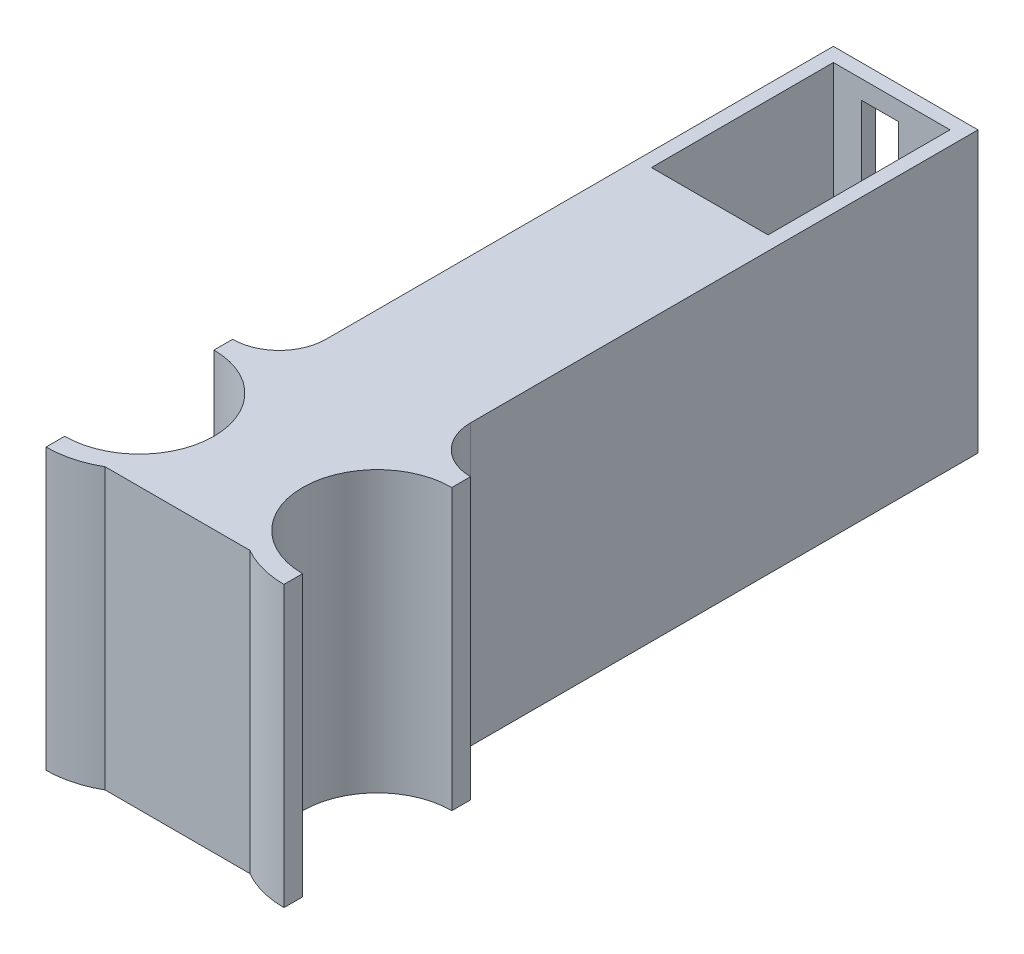
ISO-10303-21;
HEADER;
FILE_DESCRIPTION(('STEP AP214'),'2;1');
FILE_NAME('part.step','',(''),(''),'','','');
FILE_SCHEMA(('AUTOMOTIVE_DESIGN { 1 0 10303 214 1 1 1 1 }'));
ENDSEC;
DATA;
#1=APPLICATION_CONTEXT('core data for automotive mechanical design processes');
#2=APPLICATION_PROTOCOL_DEFINITION('international standard','automotive_design',2000,#1);
#3=PRODUCT_CONTEXT('',#1,'mechanical');
#4=PRODUCT('Part','Part','',(#3));
#5=PRODUCT_RELATED_PRODUCT_CATEGORY('part','',(#4));
#6=PRODUCT_DEFINITION_FORMATION('','',#4);
#7=PRODUCT_DEFINITION_CONTEXT('part definition',#1,'design');
#8=PRODUCT_DEFINITION('design','',#6,#7);
#9=PRODUCT_DEFINITION_SHAPE('','',#8);
#10=(LENGTH_UNIT() NAMED_UNIT(*) SI_UNIT(.MILLI.,.METRE.));
#11=(NAMED_UNIT(*) PLANE_ANGLE_UNIT() SI_UNIT($,.RADIAN.));
#12=(NAMED_UNIT(*) SI_UNIT($,.STERADIAN.) SOLID_ANGLE_UNIT());
#13=UNCERTAINTY_MEASURE_WITH_UNIT(LENGTH_MEASURE(1.E-05),#10,'distance_accuracy_value','');
#14=(GEOMETRIC_REPRESENTATION_CONTEXT(3) GLOBAL_UNCERTAINTY_ASSIGNED_CONTEXT((#13)) GLOBAL_UNIT_ASSIGNED_CONTEXT((#10,
#11,#12)) REPRESENTATION_CONTEXT('',''));
#15=CARTESIAN_POINT('',(0.,0.,0.));
#16=DIRECTION('',(0.,0.,1.));
#17=DIRECTION('',(1.,0.,0.));
#18=AXIS2_PLACEMENT_3D('',#15,#16,#17);
#19=CARTESIAN_POINT('',(0.,60.,0.));
#20=DIRECTION('',(0.,1.,0.));
#21=DIRECTION('',(0.,0.,1.));
#22=AXIS2_PLACEMENT_3D('',#19,#20,#21);
#23=PLANE('',#22);
#24=DIRECTION('',(0.,0.,1.));
#25=VECTOR('',#24,1.);
#26=CARTESIAN_POINT('',(-15.5,60.,-22.5));
#27=LINE('',#26,#25);
#28=CARTESIAN_POINT('',(-15.5,60.,-22.5));
#29=VERTEX_POINT('',#28);
#30=CARTESIAN_POINT('',(-15.5,60.,86.2574395006161));
#31=VERTEX_POINT('',#30);
#32=EDGE_CURVE('E322',#29,#31,#27,.T.);
#33=ORIENTED_EDGE('',*,*,#32,.T.);
#34=CARTESIAN_POINT('',(-25.5,60.,86.2574395006161));
#35=DIRECTION('',(0.,1.,0.));
#36=DIRECTION('',(0.,0.,1.));
#37=AXIS2_PLACEMENT_3D('',#34,#35,#36);
#38=CIRCLE('',#37,10.);
#39=CARTESIAN_POINT('',(-25.5,60.,96.2574395006161));
#40=VERTEX_POINT('',#39);
#41=EDGE_CURVE('E352',#31,#40,#38,.F.);
#42=ORIENTED_EDGE('',*,*,#41,.T.);
#43=DIRECTION('',(0.,0.,-1.));
#44=VECTOR('',#43,1.);
#45=CARTESIAN_POINT('',(-25.5,60.,0.));
#46=LINE('',#45,#44);
#47=CARTESIAN_POINT('',(-25.5,60.,100.257439500616));
#48=VERTEX_POINT('',#47);
#49=EDGE_CURVE('E252',#48,#40,#46,.T.);
#50=ORIENTED_EDGE('',*,*,#49,.F.);
#51=CARTESIAN_POINT('',(-25.5,60.,116.257439500616));
#52=DIRECTION('',(0.,1.,0.));
#53=DIRECTION('',(0.,0.,1.));
#54=AXIS2_PLACEMENT_3D('',#51,#52,#53);
#55=CIRCLE('',#54,16.);
#56=CARTESIAN_POINT('',(-25.5,60.,132.257439500616));
#57=VERTEX_POINT('',#56);
#58=EDGE_CURVE('E255',#57,#48,#55,.T.);
#59=ORIENTED_EDGE('',*,*,#58,.F.);
#60=DIRECTION('',(0.,0.,-1.));
#61=VECTOR('',#60,1.);
#62=CARTESIAN_POINT('',(-25.5,60.,0.));
#63=LINE('',#62,#61);
#64=CARTESIAN_POINT('',(-25.5,60.,136.257439500616));
#65=VERTEX_POINT('',#64);
#66=EDGE_CURVE('E257',#65,#57,#63,.T.);
#67=ORIENTED_EDGE('',*,*,#66,.F.);
#68=CARTESIAN_POINT('',(-25.5,60.,116.257439500616));
#69=DIRECTION('',(0.,1.,0.));
#70=DIRECTION('',(0.,0.,1.));
#71=AXIS2_PLACEMENT_3D('',#68,#69,#70);
#72=CIRCLE('',#71,20.);
#73=CARTESIAN_POINT('',(-15.5,60.,133.577947576305));
#74=VERTEX_POINT('',#73);
#75=EDGE_CURVE('E259',#65,#74,#72,.T.);
#76=ORIENTED_EDGE('',*,*,#75,.T.);
#77=DIRECTION('',(1.,0.,0.));
#78=VECTOR('',#77,1.);
#79=CARTESIAN_POINT('',(0.,60.,133.577947576305));
#80=LINE('',#79,#78);
#81=CARTESIAN_POINT('',(15.5,60.,133.577947576305));
#82=VERTEX_POINT('',#81);
#83=EDGE_CURVE('E262',#74,#82,#80,.T.);
#84=ORIENTED_EDGE('',*,*,#83,.T.);
#85=CARTESIAN_POINT('',(25.5,60.,116.257439500616));
#86=DIRECTION('',(0.,1.,0.));
#87=DIRECTION('',(0.,0.,1.));
#88=AXIS2_PLACEMENT_3D('',#85,#86,#87);
#89=CIRCLE('',#88,20.);
#90=CARTESIAN_POINT('',(25.5,60.,136.257439500616));
#91=VERTEX_POINT('',#90);
#92=EDGE_CURVE('E224',#91,#82,#89,.F.);
#93=ORIENTED_EDGE('',*,*,#92,.F.);
#94=DIRECTION('',(0.,0.,-1.));
#95=VECTOR('',#94,1.);
#96=CARTESIAN_POINT('',(25.5,60.,0.));
#97=LINE('',#96,#95);
#98=CARTESIAN_POINT('',(25.5,60.,132.257439500616));
#99=VERTEX_POINT('',#98);
#100=EDGE_CURVE('E217',#91,#99,#97,.T.);
#101=ORIENTED_EDGE('',*,*,#100,.T.);
#102=CARTESIAN_POINT('',(25.5,60.,116.257439500616));
#103=DIRECTION('',(0.,1.,0.));
#104=DIRECTION('',(0.,0.,1.));
#105=AXIS2_PLACEMENT_3D('',#102,#103,#104);
#106=CIRCLE('',#105,16.);
#107=CARTESIAN_POINT('',(25.5,60.,100.257439500616));
#108=VERTEX_POINT('',#107);
#109=EDGE_CURVE('E247',#99,#108,#106,.F.);
#110=ORIENTED_EDGE('',*,*,#109,.T.);
#111=DIRECTION('',(0.,0.,-1.));
#112=VECTOR('',#111,1.);
#113=CARTESIAN_POINT('',(25.4999999999998,60.,0.));
#114=LINE('',#113,#112);
#115=CARTESIAN_POINT('',(25.5,60.,96.2574395006161));
#116=VERTEX_POINT('',#115);
#117=EDGE_CURVE('E250',#108,#116,#114,.T.);
#118=ORIENTED_EDGE('',*,*,#117,.T.);
#119=CARTESIAN_POINT('',(25.5,60.,86.2574395006161));
#120=DIRECTION('',(0.,1.,0.));
#121=DIRECTION('',(0.,0.,1.));
#122=AXIS2_PLACEMENT_3D('',#119,#120,#121);
#123=CIRCLE('',#122,10.);
#124=CARTESIAN_POINT('',(15.5,60.,86.2574395006161));
#125=VERTEX_POINT('',#124);
#126=EDGE_CURVE('E45',#116,#125,#123,.F.);
#127=ORIENTED_EDGE('',*,*,#126,.T.);
#128=DIRECTION('',(0.,0.,-1.));
#129=VECTOR('',#128,1.);
#130=CARTESIAN_POINT('',(15.5,60.,-22.5));
#131=LINE('',#130,#129);
#132=CARTESIAN_POINT('',(15.5,60.,-22.5));
#133=VERTEX_POINT('',#132);
#134=EDGE_CURVE('E325',#125,#133,#131,.T.);
#135=ORIENTED_EDGE('',*,*,#134,.T.);
#136=DIRECTION('',(-1.,0.,0.));
#137=VECTOR('',#136,1.);
#138=CARTESIAN_POINT('',(-15.5,60.,-22.5));
#139=LINE('',#138,#137);
#140=EDGE_CURVE('E328',#133,#29,#139,.T.);
#141=ORIENTED_EDGE('',*,*,#140,.T.);
#142=EDGE_LOOP('',(#33,#42,#50,#59,#67,#76,#84,#93,#101,#110,#118,#127,#135,#141));
#143=FACE_BOUND('',#142,.T.);
#144=DIRECTION('',(-1.,0.,0.));
#145=VECTOR('',#144,1.);
#146=CARTESIAN_POINT('',(-12.5,60.,-19.5));
#147=LINE('',#146,#145);
#148=CARTESIAN_POINT('',(12.5,60.,-19.5));
#149=VERTEX_POINT('',#148);
#150=CARTESIAN_POINT('',(-12.5,60.,-19.5));
#151=VERTEX_POINT('',#150);
#152=EDGE_CURVE('E293',#149,#151,#147,.T.);
#153=ORIENTED_EDGE('',*,*,#152,.F.);
#154=DIRECTION('',(0.,0.,-1.));
#155=VECTOR('',#154,1.);
#156=CARTESIAN_POINT('',(12.5,60.,-19.5));
#157=LINE('',#156,#155);
#158=CARTESIAN_POINT('',(12.5,60.,19.5));
#159=VERTEX_POINT('',#158);
#160=EDGE_CURVE('E291',#159,#149,#157,.T.);
#161=ORIENTED_EDGE('',*,*,#160,.F.);
#162=DIRECTION('',(1.,0.,0.));
#163=VECTOR('',#162,1.);
#164=CARTESIAN_POINT('',(-12.5,60.,19.5));
#165=LINE('',#164,#163);
#166=CARTESIAN_POINT('',(-12.5,60.,19.5));
#167=VERTEX_POINT('',#166);
#168=EDGE_CURVE('E299',#167,#159,#165,.T.);
#169=ORIENTED_EDGE('',*,*,#168,.F.);
#170=DIRECTION('',(0.,0.,1.));
#171=VECTOR('',#170,1.);
#172=CARTESIAN_POINT('',(-12.5,60.,-19.5));
#173=LINE('',#172,#171);
#174=EDGE_CURVE('E296',#151,#167,#173,.T.);
#175=ORIENTED_EDGE('',*,*,#174,.F.);
#176=EDGE_LOOP('',(#153,#161,#169,#175));
#177=FACE_BOUND('',#176,.T.);
#178=ADVANCED_FACE('F37',(#143,#177),#23,.T.);
#179=CARTESIAN_POINT('',(0.,0.,0.));
#180=DIRECTION('',(0.,1.,0.));
#181=DIRECTION('',(0.,0.,1.));
#182=AXIS2_PLACEMENT_3D('',#179,#180,#181);
#183=PLANE('',#182);
#184=DIRECTION('',(0.,0.,1.));
#185=VECTOR('',#184,1.);
#186=CARTESIAN_POINT('',(-15.5,0.,-22.5));
#187=LINE('',#186,#185);
#188=CARTESIAN_POINT('',(-15.5,0.,-22.5));
#189=VERTEX_POINT('',#188);
#190=CARTESIAN_POINT('',(-15.5,0.,86.2574395006161));
#191=VERTEX_POINT('',#190);
#192=EDGE_CURVE('E321',#189,#191,#187,.T.);
#193=ORIENTED_EDGE('',*,*,#192,.F.);
#194=DIRECTION('',(-1.,0.,0.));
#195=VECTOR('',#194,1.);
#196=CARTESIAN_POINT('',(-15.5,0.,-22.5));
#197=LINE('',#196,#195);
#198=CARTESIAN_POINT('',(15.5,0.,-22.5));
#199=VERTEX_POINT('',#198);
#200=EDGE_CURVE('E326',#199,#189,#197,.T.);
#201=ORIENTED_EDGE('',*,*,#200,.F.);
#202=DIRECTION('',(0.,0.,-1.));
#203=VECTOR('',#202,1.);
#204=CARTESIAN_POINT('',(15.5,0.,-22.5));
#205=LINE('',#204,#203);
#206=CARTESIAN_POINT('',(15.5,0.,86.2574395006161));
#207=VERTEX_POINT('',#206);
#208=EDGE_CURVE('E333',#207,#199,#205,.T.);
#209=ORIENTED_EDGE('',*,*,#208,.F.);
#210=CARTESIAN_POINT('',(25.5,0.,86.2574395006161));
#211=DIRECTION('',(0.,1.,0.));
#212=DIRECTION('',(0.,0.,1.));
#213=AXIS2_PLACEMENT_3D('',#210,#211,#212);
#214=CIRCLE('',#213,10.);
#215=CARTESIAN_POINT('',(25.5,0.,96.2574395006161));
#216=VERTEX_POINT('',#215);
#217=EDGE_CURVE('E11',#207,#216,#214,.T.);
#218=ORIENTED_EDGE('',*,*,#217,.T.);
#219=DIRECTION('',(0.,0.,-1.));
#220=VECTOR('',#219,1.);
#221=CARTESIAN_POINT('',(25.4999999999998,0.,0.));
#222=LINE('',#221,#220);
#223=CARTESIAN_POINT('',(25.5,0.,100.257439500616));
#224=VERTEX_POINT('',#223);
#225=EDGE_CURVE('E227',#224,#216,#222,.T.);
#226=ORIENTED_EDGE('',*,*,#225,.F.);
#227=CARTESIAN_POINT('',(25.5,0.,116.257439500616));
#228=DIRECTION('',(0.,1.,0.));
#229=DIRECTION('',(0.,0.,1.));
#230=AXIS2_PLACEMENT_3D('',#227,#228,#229);
#231=CIRCLE('',#230,16.);
#232=CARTESIAN_POINT('',(25.5,0.,132.257439500616));
#233=VERTEX_POINT('',#232);
#234=EDGE_CURVE('E223',#233,#224,#231,.F.);
#235=ORIENTED_EDGE('',*,*,#234,.F.);
#236=DIRECTION('',(0.,0.,-1.));
#237=VECTOR('',#236,1.);
#238=CARTESIAN_POINT('',(25.5,0.,0.));
#239=LINE('',#238,#237);
#240=CARTESIAN_POINT('',(25.5,0.,136.257439500616));
#241=VERTEX_POINT('',#240);
#242=EDGE_CURVE('E220',#241,#233,#239,.T.);
#243=ORIENTED_EDGE('',*,*,#242,.F.);
#244=CARTESIAN_POINT('',(25.5,0.,116.257439500616));
#245=DIRECTION('',(0.,1.,0.));
#246=DIRECTION('',(0.,0.,1.));
#247=AXIS2_PLACEMENT_3D('',#244,#245,#246);
#248=CIRCLE('',#247,20.);
#249=CARTESIAN_POINT('',(15.5,0.,133.577947576305));
#250=VERTEX_POINT('',#249);
#251=EDGE_CURVE('E242',#241,#250,#248,.F.);
#252=ORIENTED_EDGE('',*,*,#251,.T.);
#253=DIRECTION('',(1.,0.,0.));
#254=VECTOR('',#253,1.);
#255=CARTESIAN_POINT('',(0.,0.,133.577947576305));
#256=LINE('',#255,#254);
#257=CARTESIAN_POINT('',(-15.5,0.,133.577947576305));
#258=VERTEX_POINT('',#257);
#259=EDGE_CURVE('E239',#258,#250,#256,.T.);
#260=ORIENTED_EDGE('',*,*,#259,.F.);
#261=CARTESIAN_POINT('',(-25.5,0.,116.257439500616));
#262=DIRECTION('',(0.,1.,0.));
#263=DIRECTION('',(0.,0.,1.));
#264=AXIS2_PLACEMENT_3D('',#261,#262,#263);
#265=CIRCLE('',#264,20.);
#266=CARTESIAN_POINT('',(-25.5,0.,136.257439500616));
#267=VERTEX_POINT('',#266);
#268=EDGE_CURVE('E236',#267,#258,#265,.T.);
#269=ORIENTED_EDGE('',*,*,#268,.F.);
#270=DIRECTION('',(0.,0.,-1.));
#271=VECTOR('',#270,1.);
#272=CARTESIAN_POINT('',(-25.5,0.,0.));
#273=LINE('',#272,#271);
#274=CARTESIAN_POINT('',(-25.5,0.,132.257439500616));
#275=VERTEX_POINT('',#274);
#276=EDGE_CURVE('E234',#267,#275,#273,.T.);
#277=ORIENTED_EDGE('',*,*,#276,.T.);
#278=CARTESIAN_POINT('',(-25.5,0.,116.257439500616));
#279=DIRECTION('',(0.,1.,0.));
#280=DIRECTION('',(0.,0.,1.));
#281=AXIS2_PLACEMENT_3D('',#278,#279,#280);
#282=CIRCLE('',#281,16.);
#283=CARTESIAN_POINT('',(-25.5,0.,100.257439500616));
#284=VERTEX_POINT('',#283);
#285=EDGE_CURVE('E232',#275,#284,#282,.T.);
#286=ORIENTED_EDGE('',*,*,#285,.T.);
#287=DIRECTION('',(0.,0.,-1.));
#288=VECTOR('',#287,1.);
#289=CARTESIAN_POINT('',(-25.5,0.,0.));
#290=LINE('',#289,#288);
#291=CARTESIAN_POINT('',(-25.5,0.,96.2574395006161));
#292=VERTEX_POINT('',#291);
#293=EDGE_CURVE('E230',#284,#292,#290,.T.);
#294=ORIENTED_EDGE('',*,*,#293,.T.);
#295=CARTESIAN_POINT('',(-25.5,0.,86.2574395006161));
#296=DIRECTION('',(0.,1.,0.));
#297=DIRECTION('',(0.,0.,1.));
#298=AXIS2_PLACEMENT_3D('',#295,#296,#297);
#299=CIRCLE('',#298,10.);
#300=EDGE_CURVE('E354',#292,#191,#299,.T.);
#301=ORIENTED_EDGE('',*,*,#300,.T.);
#302=EDGE_LOOP('',(#193,#201,#209,#218,#226,#235,#243,#252,#260,#269,#277,#286,#294,#301));
#303=FACE_BOUND('',#302,.T.);
#304=DIRECTION('',(0.,0.,-1.));
#305=VECTOR('',#304,1.);
#306=CARTESIAN_POINT('',(12.5,0.,-19.5));
#307=LINE('',#306,#305);
#308=CARTESIAN_POINT('',(12.5,0.,19.5));
#309=VERTEX_POINT('',#308);
#310=CARTESIAN_POINT('',(12.5,0.,-19.5));
#311=VERTEX_POINT('',#310);
#312=EDGE_CURVE('E269',#309,#311,#307,.T.);
#313=ORIENTED_EDGE('',*,*,#312,.T.);
#314=DIRECTION('',(-1.,0.,0.));
#315=VECTOR('',#314,1.);
#316=CARTESIAN_POINT('',(-12.5,0.,-19.5));
#317=LINE('',#316,#315);
#318=CARTESIAN_POINT('',(-12.5,0.,-19.5));
#319=VERTEX_POINT('',#318);
#320=EDGE_CURVE('E304',#311,#319,#317,.T.);
#321=ORIENTED_EDGE('',*,*,#320,.T.);
#322=DIRECTION('',(0.,0.,1.));
#323=VECTOR('',#322,1.);
#324=CARTESIAN_POINT('',(-12.5,0.,-19.5));
#325=LINE('',#324,#323);
#326=CARTESIAN_POINT('',(-12.5,0.,19.5));
#327=VERTEX_POINT('',#326);
#328=EDGE_CURVE('E307',#319,#327,#325,.T.);
#329=ORIENTED_EDGE('',*,*,#328,.T.);
#330=DIRECTION('',(1.,0.,0.));
#331=VECTOR('',#330,1.);
#332=CARTESIAN_POINT('',(-12.5,0.,19.5));
#333=LINE('',#332,#331);
#334=EDGE_CURVE('E294',#327,#309,#333,.T.);
#335=ORIENTED_EDGE('',*,*,#334,.T.);
#336=EDGE_LOOP('',(#313,#321,#329,#335));
#337=FACE_BOUND('',#336,.T.);
#338=ADVANCED_FACE('F358',(#303,#337),#183,.F.);
#339=CARTESIAN_POINT('',(-15.5,60.,-22.5));
#340=DIRECTION('',(1.,0.,0.));
#341=DIRECTION('',(0.,0.,-1.));
#342=AXIS2_PLACEMENT_3D('',#339,#340,#341);
#343=PLANE('',#342);
#344=ORIENTED_EDGE('',*,*,#192,.T.);
#345=DIRECTION('',(0.,1.,0.));
#346=VECTOR('',#345,1.);
#347=CARTESIAN_POINT('',(-15.5,60.,86.2574395006161));
#348=LINE('',#347,#346);
#349=EDGE_CURVE('E348',#191,#31,#348,.T.);
#350=ORIENTED_EDGE('',*,*,#349,.T.);
#351=ORIENTED_EDGE('',*,*,#32,.F.);
#352=DIRECTION('',(0.,-1.,0.));
#353=VECTOR('',#352,1.);
#354=CARTESIAN_POINT('',(-15.5,60.,-22.5));
#355=LINE('',#354,#353);
#356=EDGE_CURVE('E330',#29,#189,#355,.T.);
#357=ORIENTED_EDGE('',*,*,#356,.T.);
#358=EDGE_LOOP('',(#344,#350,#351,#357));
#359=FACE_BOUND('',#358,.T.);
#360=ADVANCED_FACE('F366',(#359),#343,.F.);
#361=CARTESIAN_POINT('',(15.5,60.,-22.5));
#362=DIRECTION('',(-1.,0.,0.));
#363=DIRECTION('',(0.,0.,1.));
#364=AXIS2_PLACEMENT_3D('',#361,#362,#363);
#365=PLANE('',#364);
#366=ORIENTED_EDGE('',*,*,#134,.F.);
#367=DIRECTION('',(0.,-1.,0.));
#368=VECTOR('',#367,1.);
#369=CARTESIAN_POINT('',(15.5,0.,86.2574395006161));
#370=LINE('',#369,#368);
#371=EDGE_CURVE('E58',#125,#207,#370,.T.);
#372=ORIENTED_EDGE('',*,*,#371,.T.);
#373=ORIENTED_EDGE('',*,*,#208,.T.);
#374=DIRECTION('',(0.,-1.,0.));
#375=VECTOR('',#374,1.);
#376=CARTESIAN_POINT('',(15.5,60.,-22.5));
#377=LINE('',#376,#375);
#378=EDGE_CURVE('E338',#133,#199,#377,.T.);
#379=ORIENTED_EDGE('',*,*,#378,.F.);
#380=EDGE_LOOP('',(#366,#372,#373,#379));
#381=FACE_BOUND('',#380,.T.);
#382=ADVANCED_FACE('F411',(#381),#365,.F.);
#383=CARTESIAN_POINT('',(-15.5,60.,-22.5));
#384=DIRECTION('',(0.,0.,1.));
#385=DIRECTION('',(1.,0.,0.));
#386=AXIS2_PLACEMENT_3D('',#383,#384,#385);
#387=PLANE('',#386);
#388=DIRECTION('',(0.,-1.,0.));
#389=VECTOR('',#388,1.);
#390=CARTESIAN_POINT('',(1.49999999999999,56.,-22.5));
#391=LINE('',#390,#389);
#392=CARTESIAN_POINT('',(1.49999999999999,56.,-22.5));
#393=VERTEX_POINT('',#392);
#394=CARTESIAN_POINT('',(1.49999999999999,4.,-22.5));
#395=VERTEX_POINT('',#394);
#396=EDGE_CURVE('E200',#393,#395,#391,.T.);
#397=ORIENTED_EDGE('',*,*,#396,.F.);
#398=DIRECTION('',(1.,0.,0.));
#399=VECTOR('',#398,1.);
#400=CARTESIAN_POINT('',(1.49999999999999,56.,-22.5));
#401=LINE('',#400,#399);
#402=CARTESIAN_POINT('',(-6.50000000000001,56.,-22.5));
#403=VERTEX_POINT('',#402);
#404=EDGE_CURVE('E205',#403,#393,#401,.T.);
#405=ORIENTED_EDGE('',*,*,#404,.F.);
#406=DIRECTION('',(0.,1.,0.));
#407=VECTOR('',#406,1.);
#408=CARTESIAN_POINT('',(-6.50000000000001,56.,-22.5));
#409=LINE('',#408,#407);
#410=CARTESIAN_POINT('',(-6.50000000000001,4.,-22.5));
#411=VERTEX_POINT('',#410);
#412=EDGE_CURVE('E210',#411,#403,#409,.T.);
#413=ORIENTED_EDGE('',*,*,#412,.F.);
#414=DIRECTION('',(-1.,0.,0.));
#415=VECTOR('',#414,1.);
#416=CARTESIAN_POINT('',(1.49999999999999,4.,-22.5));
#417=LINE('',#416,#415);
#418=EDGE_CURVE('E189',#395,#411,#417,.T.);
#419=ORIENTED_EDGE('',*,*,#418,.F.);
#420=EDGE_LOOP('',(#397,#405,#413,#419));
#421=FACE_BOUND('',#420,.T.);
#422=ORIENTED_EDGE('',*,*,#200,.T.);
#423=ORIENTED_EDGE('',*,*,#356,.F.);
#424=ORIENTED_EDGE('',*,*,#140,.F.);
#425=ORIENTED_EDGE('',*,*,#378,.T.);
#426=EDGE_LOOP('',(#422,#423,#424,#425));
#427=FACE_BOUND('',#426,.T.);
#428=ADVANCED_FACE('F207',(#421,#427),#387,.F.);
#429=CARTESIAN_POINT('',(12.5,60.,-19.5));
#430=DIRECTION('',(-1.,0.,0.));
#431=DIRECTION('',(0.,0.,1.));
#432=AXIS2_PLACEMENT_3D('',#429,#430,#431);
#433=PLANE('',#432);
#434=ORIENTED_EDGE('',*,*,#312,.F.);
#435=DIRECTION('',(0.,-1.,0.));
#436=VECTOR('',#435,1.);
#437=CARTESIAN_POINT('',(12.5,60.,19.5));
#438=LINE('',#437,#436);
#439=EDGE_CURVE('E301',#159,#309,#438,.T.);
#440=ORIENTED_EDGE('',*,*,#439,.F.);
#441=ORIENTED_EDGE('',*,*,#160,.T.);
#442=DIRECTION('',(0.,-1.,0.));
#443=VECTOR('',#442,1.);
#444=CARTESIAN_POINT('',(12.5,60.,-19.5));
#445=LINE('',#444,#443);
#446=EDGE_CURVE('E318',#149,#311,#445,.T.);
#447=ORIENTED_EDGE('',*,*,#446,.T.);
#448=EDGE_LOOP('',(#434,#440,#441,#447));
#449=FACE_BOUND('',#448,.T.);
#450=ADVANCED_FACE('F414',(#449),#433,.T.);
#451=CARTESIAN_POINT('',(-12.5,60.,-19.5));
#452=DIRECTION('',(0.,0.,1.));
#453=DIRECTION('',(1.,0.,0.));
#454=AXIS2_PLACEMENT_3D('',#451,#452,#453);
#455=PLANE('',#454);
#456=DIRECTION('',(-1.,0.,0.));
#457=VECTOR('',#456,1.);
#458=CARTESIAN_POINT('',(-12.5,56.,-19.5));
#459=LINE('',#458,#457);
#460=CARTESIAN_POINT('',(1.49999999999999,56.,-19.5));
#461=VERTEX_POINT('',#460);
#462=CARTESIAN_POINT('',(-6.50000000000001,56.,-19.5));
#463=VERTEX_POINT('',#462);
#464=EDGE_CURVE('E346',#461,#463,#459,.T.);
#465=ORIENTED_EDGE('',*,*,#464,.F.);
#466=DIRECTION('',(0.,1.,0.));
#467=VECTOR('',#466,1.);
#468=CARTESIAN_POINT('',(1.49999999999999,60.,-19.5));
#469=LINE('',#468,#467);
#470=CARTESIAN_POINT('',(1.49999999999999,4.,-19.5));
#471=VERTEX_POINT('',#470);
#472=EDGE_CURVE('E341',#471,#461,#469,.T.);
#473=ORIENTED_EDGE('',*,*,#472,.F.);
#474=DIRECTION('',(1.,0.,0.));
#475=VECTOR('',#474,1.);
#476=CARTESIAN_POINT('',(-12.5,4.,-19.5));
#477=LINE('',#476,#475);
#478=CARTESIAN_POINT('',(-6.50000000000001,4.,-19.5));
#479=VERTEX_POINT('',#478);
#480=EDGE_CURVE('E192',#479,#471,#477,.T.);
#481=ORIENTED_EDGE('',*,*,#480,.F.);
#482=DIRECTION('',(0.,-1.,0.));
#483=VECTOR('',#482,1.);
#484=CARTESIAN_POINT('',(-6.50000000000001,60.,-19.5));
#485=LINE('',#484,#483);
#486=EDGE_CURVE('E344',#463,#479,#485,.T.);
#487=ORIENTED_EDGE('',*,*,#486,.F.);
#488=EDGE_LOOP('',(#465,#473,#481,#487));
#489=FACE_BOUND('',#488,.T.);
#490=ORIENTED_EDGE('',*,*,#320,.F.);
#491=ORIENTED_EDGE('',*,*,#446,.F.);
#492=ORIENTED_EDGE('',*,*,#152,.T.);
#493=DIRECTION('',(0.,-1.,0.));
#494=VECTOR('',#493,1.);
#495=CARTESIAN_POINT('',(-12.5,60.,-19.5));
#496=LINE('',#495,#494);
#497=EDGE_CURVE('E316',#151,#319,#496,.T.);
#498=ORIENTED_EDGE('',*,*,#497,.T.);
#499=EDGE_LOOP('',(#490,#491,#492,#498));
#500=FACE_BOUND('',#499,.T.);
#501=ADVANCED_FACE('F420',(#489,#500),#455,.T.);
#502=CARTESIAN_POINT('',(-12.5,60.,-19.5));
#503=DIRECTION('',(1.,0.,0.));
#504=DIRECTION('',(0.,0.,-1.));
#505=AXIS2_PLACEMENT_3D('',#502,#503,#504);
#506=PLANE('',#505);
#507=ORIENTED_EDGE('',*,*,#328,.F.);
#508=ORIENTED_EDGE('',*,*,#497,.F.);
#509=ORIENTED_EDGE('',*,*,#174,.T.);
#510=DIRECTION('',(0.,-1.,0.));
#511=VECTOR('',#510,1.);
#512=CARTESIAN_POINT('',(-12.5,60.,19.5));
#513=LINE('',#512,#511);
#514=EDGE_CURVE('E314',#167,#327,#513,.T.);
#515=ORIENTED_EDGE('',*,*,#514,.T.);
#516=EDGE_LOOP('',(#507,#508,#509,#515));
#517=FACE_BOUND('',#516,.T.);
#518=ADVANCED_FACE('F433',(#517),#506,.T.);
#519=CARTESIAN_POINT('',(-12.5,60.,19.5));
#520=DIRECTION('',(0.,0.,-1.));
#521=DIRECTION('',(-1.,0.,0.));
#522=AXIS2_PLACEMENT_3D('',#519,#520,#521);
#523=PLANE('',#522);
#524=ORIENTED_EDGE('',*,*,#334,.F.);
#525=ORIENTED_EDGE('',*,*,#514,.F.);
#526=ORIENTED_EDGE('',*,*,#168,.T.);
#527=ORIENTED_EDGE('',*,*,#439,.T.);
#528=EDGE_LOOP('',(#524,#525,#526,#527));
#529=FACE_BOUND('',#528,.T.);
#530=ADVANCED_FACE('F437',(#529),#523,.T.);
#531=CARTESIAN_POINT('',(25.5,0.,0.));
#532=DIRECTION('',(1.,0.,0.));
#533=DIRECTION('',(0.,0.,-1.));
#534=AXIS2_PLACEMENT_3D('',#531,#532,#533);
#535=PLANE('',#534);
#536=ORIENTED_EDGE('',*,*,#100,.F.);
#537=DIRECTION('',(0.,1.,0.));
#538=VECTOR('',#537,1.);
#539=CARTESIAN_POINT('',(25.5,0.,136.257439500616));
#540=LINE('',#539,#538);
#541=EDGE_CURVE('E267',#241,#91,#540,.T.);
#542=ORIENTED_EDGE('',*,*,#541,.F.);
#543=ORIENTED_EDGE('',*,*,#242,.T.);
#544=DIRECTION('',(0.,1.,0.));
#545=VECTOR('',#544,1.);
#546=CARTESIAN_POINT('',(25.5,0.,132.257439500616));
#547=LINE('',#546,#545);
#548=EDGE_CURVE('E244',#233,#99,#547,.T.);
#549=ORIENTED_EDGE('',*,*,#548,.T.);
#550=EDGE_LOOP('',(#536,#542,#543,#549));
#551=FACE_BOUND('',#550,.T.);
#552=ADVANCED_FACE('F396',(#551),#535,.T.);
#553=CARTESIAN_POINT('',(25.5,0.,116.257439500616));
#554=DIRECTION('',(0.,1.,0.));
#555=DIRECTION('',(0.,0.,1.));
#556=AXIS2_PLACEMENT_3D('',#553,#554,#555);
#557=CYLINDRICAL_SURFACE('',#556,20.);
#558=ORIENTED_EDGE('',*,*,#92,.T.);
#559=DIRECTION('',(0.,1.,0.));
#560=VECTOR('',#559,1.);
#561=CARTESIAN_POINT('',(15.5,0.,133.577947576305));
#562=LINE('',#561,#560);
#563=EDGE_CURVE('E270',#250,#82,#562,.T.);
#564=ORIENTED_EDGE('',*,*,#563,.F.);
#565=ORIENTED_EDGE('',*,*,#251,.F.);
#566=ORIENTED_EDGE('',*,*,#541,.T.);
#567=EDGE_LOOP('',(#558,#564,#565,#566));
#568=FACE_BOUND('',#567,.T.);
#569=ADVANCED_FACE('F444',(#568),#557,.T.);
#570=CARTESIAN_POINT('',(0.,0.,133.577947576305));
#571=DIRECTION('',(0.,0.,1.));
#572=DIRECTION('',(1.,0.,0.));
#573=AXIS2_PLACEMENT_3D('',#570,#571,#572);
#574=PLANE('',#573);
#575=ORIENTED_EDGE('',*,*,#83,.F.);
#576=DIRECTION('',(0.,1.,0.));
#577=VECTOR('',#576,1.);
#578=CARTESIAN_POINT('',(-15.5,0.,133.577947576305));
#579=LINE('',#578,#577);
#580=EDGE_CURVE('E272',#258,#74,#579,.T.);
#581=ORIENTED_EDGE('',*,*,#580,.F.);
#582=ORIENTED_EDGE('',*,*,#259,.T.);
#583=ORIENTED_EDGE('',*,*,#563,.T.);
#584=EDGE_LOOP('',(#575,#581,#582,#583));
#585=FACE_BOUND('',#584,.T.);
#586=ADVANCED_FACE('F390',(#585),#574,.T.);
#587=CARTESIAN_POINT('',(-25.5,0.,116.257439500616));
#588=DIRECTION('',(0.,1.,0.));
#589=DIRECTION('',(0.,0.,1.));
#590=AXIS2_PLACEMENT_3D('',#587,#588,#589);
#591=CYLINDRICAL_SURFACE('',#590,20.);
#592=ORIENTED_EDGE('',*,*,#75,.F.);
#593=DIRECTION('',(0.,1.,0.));
#594=VECTOR('',#593,1.);
#595=CARTESIAN_POINT('',(-25.5,0.,136.257439500616));
#596=LINE('',#595,#594);
#597=EDGE_CURVE('E274',#267,#65,#596,.T.);
#598=ORIENTED_EDGE('',*,*,#597,.F.);
#599=ORIENTED_EDGE('',*,*,#268,.T.);
#600=ORIENTED_EDGE('',*,*,#580,.T.);
#601=EDGE_LOOP('',(#592,#598,#599,#600));
#602=FACE_BOUND('',#601,.T.);
#603=ADVANCED_FACE('F384',(#602),#591,.T.);
#604=CARTESIAN_POINT('',(-25.5,0.,0.));
#605=DIRECTION('',(1.,0.,0.));
#606=DIRECTION('',(0.,0.,-1.));
#607=AXIS2_PLACEMENT_3D('',#604,#605,#606);
#608=PLANE('',#607);
#609=ORIENTED_EDGE('',*,*,#66,.T.);
#610=DIRECTION('',(0.,1.,0.));
#611=VECTOR('',#610,1.);
#612=CARTESIAN_POINT('',(-25.5,0.,132.257439500616));
#613=LINE('',#612,#611);
#614=EDGE_CURVE('E276',#275,#57,#613,.T.);
#615=ORIENTED_EDGE('',*,*,#614,.F.);
#616=ORIENTED_EDGE('',*,*,#276,.F.);
#617=ORIENTED_EDGE('',*,*,#597,.T.);
#618=EDGE_LOOP('',(#609,#615,#616,#617));
#619=FACE_BOUND('',#618,.T.);
#620=ADVANCED_FACE('F454',(#619),#608,.F.);
#621=CARTESIAN_POINT('',(-25.5,0.,116.257439500616));
#622=DIRECTION('',(0.,1.,0.));
#623=DIRECTION('',(0.,0.,1.));
#624=AXIS2_PLACEMENT_3D('',#621,#622,#623);
#625=CYLINDRICAL_SURFACE('',#624,16.);
#626=ORIENTED_EDGE('',*,*,#58,.T.);
#627=DIRECTION('',(0.,1.,0.));
#628=VECTOR('',#627,1.);
#629=CARTESIAN_POINT('',(-25.5,0.,100.257439500616));
#630=LINE('',#629,#628);
#631=EDGE_CURVE('E279',#284,#48,#630,.T.);
#632=ORIENTED_EDGE('',*,*,#631,.F.);
#633=ORIENTED_EDGE('',*,*,#285,.F.);
#634=ORIENTED_EDGE('',*,*,#614,.T.);
#635=EDGE_LOOP('',(#626,#632,#633,#634));
#636=FACE_BOUND('',#635,.T.);
#637=ADVANCED_FACE('F378',(#636),#625,.F.);
#638=CARTESIAN_POINT('',(-25.5,0.,0.));
#639=DIRECTION('',(1.,0.,0.));
#640=DIRECTION('',(0.,0.,-1.));
#641=AXIS2_PLACEMENT_3D('',#638,#639,#640);
#642=PLANE('',#641);
#643=ORIENTED_EDGE('',*,*,#49,.T.);
#644=DIRECTION('',(0.,1.,0.));
#645=VECTOR('',#644,1.);
#646=CARTESIAN_POINT('',(-25.5,0.,96.2574395006161));
#647=LINE('',#646,#645);
#648=EDGE_CURVE('E282',#292,#40,#647,.T.);
#649=ORIENTED_EDGE('',*,*,#648,.F.);
#650=ORIENTED_EDGE('',*,*,#293,.F.);
#651=ORIENTED_EDGE('',*,*,#631,.T.);
#652=EDGE_LOOP('',(#643,#649,#650,#651));
#653=FACE_BOUND('',#652,.T.);
#654=ADVANCED_FACE('F374',(#653),#642,.F.);
#655=CARTESIAN_POINT('',(25.4999999999998,0.,0.));
#656=DIRECTION('',(1.,0.,0.));
#657=DIRECTION('',(0.,0.,-1.));
#658=AXIS2_PLACEMENT_3D('',#655,#656,#657);
#659=PLANE('',#658);
#660=ORIENTED_EDGE('',*,*,#117,.F.);
#661=DIRECTION('',(0.,1.,0.));
#662=VECTOR('',#661,1.);
#663=CARTESIAN_POINT('',(25.5,0.,100.257439500616));
#664=LINE('',#663,#662);
#665=EDGE_CURVE('E288',#224,#108,#664,.T.);
#666=ORIENTED_EDGE('',*,*,#665,.F.);
#667=ORIENTED_EDGE('',*,*,#225,.T.);
#668=DIRECTION('',(0.,1.,0.));
#669=VECTOR('',#668,1.);
#670=CARTESIAN_POINT('',(25.5,0.,96.2574395006161));
#671=LINE('',#670,#669);
#672=EDGE_CURVE('E285',#216,#116,#671,.T.);
#673=ORIENTED_EDGE('',*,*,#672,.T.);
#674=EDGE_LOOP('',(#660,#666,#667,#673));
#675=FACE_BOUND('',#674,.T.);
#676=ADVANCED_FACE('F405',(#675),#659,.T.);
#677=CARTESIAN_POINT('',(25.5,0.,116.257439500616));
#678=DIRECTION('',(0.,1.,0.));
#679=DIRECTION('',(0.,0.,1.));
#680=AXIS2_PLACEMENT_3D('',#677,#678,#679);
#681=CYLINDRICAL_SURFACE('',#680,16.);
#682=ORIENTED_EDGE('',*,*,#109,.F.);
#683=ORIENTED_EDGE('',*,*,#548,.F.);
#684=ORIENTED_EDGE('',*,*,#234,.T.);
#685=ORIENTED_EDGE('',*,*,#665,.T.);
#686=EDGE_LOOP('',(#682,#683,#684,#685));
#687=FACE_BOUND('',#686,.T.);
#688=ADVANCED_FACE('F402',(#687),#681,.F.);
#689=CARTESIAN_POINT('',(1.49999999999999,56.,-13.5));
#690=DIRECTION('',(0.,1.,0.));
#691=DIRECTION('',(0.,0.,1.));
#692=AXIS2_PLACEMENT_3D('',#689,#690,#691);
#693=PLANE('',#692);
#694=ORIENTED_EDGE('',*,*,#464,.T.);
#695=DIRECTION('',(0.,0.,-1.));
#696=VECTOR('',#695,1.);
#697=CARTESIAN_POINT('',(-6.50000000000001,56.,-13.5));
#698=LINE('',#697,#696);
#699=EDGE_CURVE('E215',#463,#403,#698,.T.);
#700=ORIENTED_EDGE('',*,*,#699,.T.);
#701=ORIENTED_EDGE('',*,*,#404,.T.);
#702=DIRECTION('',(0.,0.,-1.));
#703=VECTOR('',#702,1.);
#704=CARTESIAN_POINT('',(1.49999999999999,56.,-13.5));
#705=LINE('',#704,#703);
#706=EDGE_CURVE('E196',#461,#393,#705,.T.);
#707=ORIENTED_EDGE('',*,*,#706,.F.);
#708=EDGE_LOOP('',(#694,#700,#701,#707));
#709=FACE_BOUND('',#708,.T.);
#710=ADVANCED_FACE('F447',(#709),#693,.F.);
#711=CARTESIAN_POINT('',(-6.50000000000001,56.,-13.5));
#712=DIRECTION('',(-1.,0.,0.));
#713=DIRECTION('',(0.,-1.,0.));
#714=AXIS2_PLACEMENT_3D('',#711,#712,#713);
#715=PLANE('',#714);
#716=ORIENTED_EDGE('',*,*,#486,.T.);
#717=DIRECTION('',(0.,0.,-1.));
#718=VECTOR('',#717,1.);
#719=CARTESIAN_POINT('',(-6.50000000000001,4.,-13.5));
#720=LINE('',#719,#718);
#721=EDGE_CURVE('E195',#479,#411,#720,.T.);
#722=ORIENTED_EDGE('',*,*,#721,.T.);
#723=ORIENTED_EDGE('',*,*,#412,.T.);
#724=ORIENTED_EDGE('',*,*,#699,.F.);
#725=EDGE_LOOP('',(#716,#722,#723,#724));
#726=FACE_BOUND('',#725,.T.);
#727=ADVANCED_FACE('F465',(#726),#715,.F.);
#728=CARTESIAN_POINT('',(1.49999999999999,4.,-13.5));
#729=DIRECTION('',(0.,-1.,0.));
#730=DIRECTION('',(0.,0.,-1.));
#731=AXIS2_PLACEMENT_3D('',#728,#729,#730);
#732=PLANE('',#731);
#733=ORIENTED_EDGE('',*,*,#480,.T.);
#734=DIRECTION('',(0.,0.,-1.));
#735=VECTOR('',#734,1.);
#736=CARTESIAN_POINT('',(1.49999999999999,4.,-13.5));
#737=LINE('',#736,#735);
#738=EDGE_CURVE('E184',#471,#395,#737,.T.);
#739=ORIENTED_EDGE('',*,*,#738,.T.);
#740=ORIENTED_EDGE('',*,*,#418,.T.);
#741=ORIENTED_EDGE('',*,*,#721,.F.);
#742=EDGE_LOOP('',(#733,#739,#740,#741));
#743=FACE_BOUND('',#742,.T.);
#744=ADVANCED_FACE('F186',(#743),#732,.F.);
#745=CARTESIAN_POINT('',(1.49999999999999,56.,-13.5));
#746=DIRECTION('',(1.,0.,0.));
#747=DIRECTION('',(0.,1.,0.));
#748=AXIS2_PLACEMENT_3D('',#745,#746,#747);
#749=PLANE('',#748);
#750=ORIENTED_EDGE('',*,*,#472,.T.);
#751=ORIENTED_EDGE('',*,*,#706,.T.);
#752=ORIENTED_EDGE('',*,*,#396,.T.);
#753=ORIENTED_EDGE('',*,*,#738,.F.);
#754=EDGE_LOOP('',(#750,#751,#752,#753));
#755=FACE_BOUND('',#754,.T.);
#756=ADVANCED_FACE('F201',(#755),#749,.F.);
#757=CARTESIAN_POINT('',(-25.5,0.,86.2574395006161));
#758=DIRECTION('',(0.,1.,0.));
#759=DIRECTION('',(0.,0.,1.));
#760=AXIS2_PLACEMENT_3D('',#757,#758,#759);
#761=CYLINDRICAL_SURFACE('',#760,10.);
#762=ORIENTED_EDGE('',*,*,#300,.F.);
#763=ORIENTED_EDGE('',*,*,#648,.T.);
#764=ORIENTED_EDGE('',*,*,#41,.F.);
#765=ORIENTED_EDGE('',*,*,#349,.F.);
#766=EDGE_LOOP('',(#762,#763,#764,#765));
#767=FACE_BOUND('',#766,.T.);
#768=ADVANCED_FACE('F369',(#767),#761,.F.);
#769=CARTESIAN_POINT('',(25.5,0.,86.2574395006161));
#770=DIRECTION('',(0.,1.,0.));
#771=DIRECTION('',(0.,0.,1.));
#772=AXIS2_PLACEMENT_3D('',#769,#770,#771);
#773=CYLINDRICAL_SURFACE('',#772,10.);
#774=ORIENTED_EDGE('',*,*,#217,.F.);
#775=ORIENTED_EDGE('',*,*,#371,.F.);
#776=ORIENTED_EDGE('',*,*,#126,.F.);
#777=ORIENTED_EDGE('',*,*,#672,.F.);
#778=EDGE_LOOP('',(#774,#775,#776,#777));
#779=FACE_BOUND('',#778,.T.);
#780=ADVANCED_FACE('F39',(#779),#773,.F.);
#781=CLOSED_SHELL('',(#178,#338,#360,#382,#428,#450,#501,#518,#530,#552,#569,#586,#603,#620,
#637,#654,#676,#688,#710,#727,#744,#756,#768,#780));
#782=MANIFOLD_SOLID_BREP('B2',#781);
#783=ADVANCED_BREP_SHAPE_REPRESENTATION('',(#18,#782),#14);
#784=SHAPE_DEFINITION_REPRESENTATION(#9,#783);
ENDSEC;
END-ISO-10303-21;
